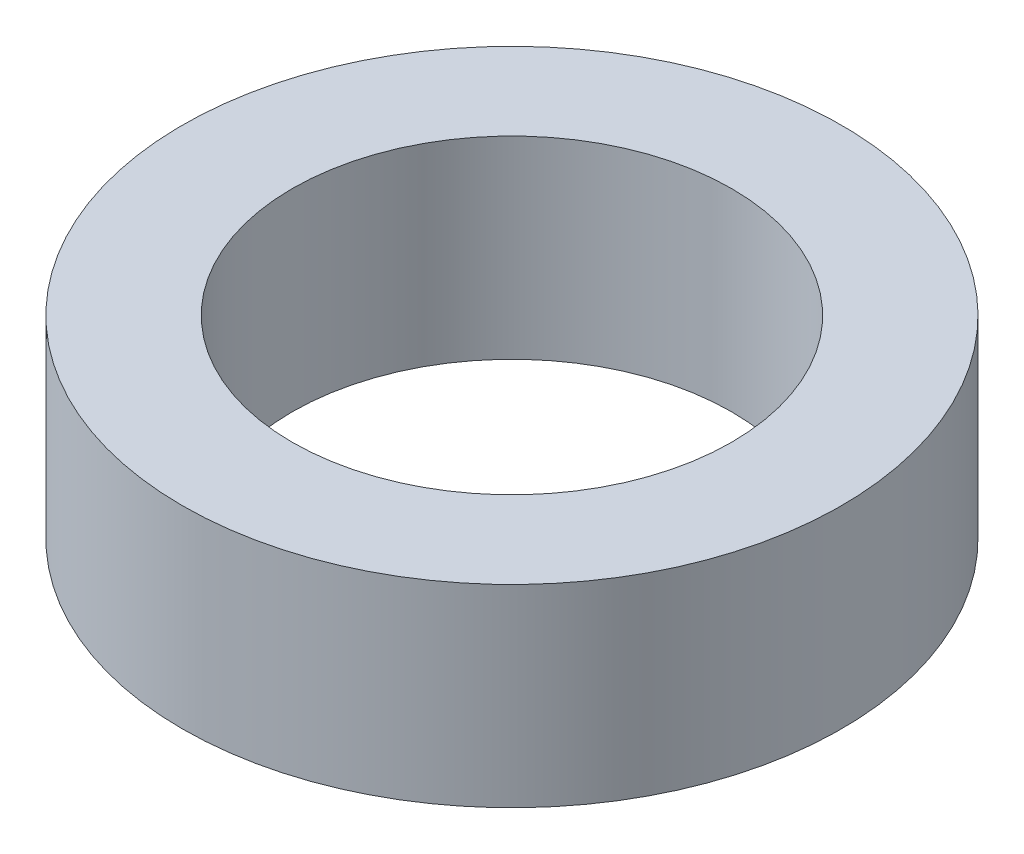
ISO-10303-21;
HEADER;
FILE_DESCRIPTION(('STEP AP214'),'2;1');
FILE_NAME('part.step','',(''),(''),'','','');
FILE_SCHEMA(('AUTOMOTIVE_DESIGN { 1 0 10303 214 1 1 1 1 }'));
ENDSEC;
DATA;
#1=APPLICATION_CONTEXT('core data for automotive mechanical design processes');
#2=APPLICATION_PROTOCOL_DEFINITION('international standard','automotive_design',2000,#1);
#3=PRODUCT_CONTEXT('',#1,'mechanical');
#4=PRODUCT('Part','Part','',(#3));
#5=PRODUCT_RELATED_PRODUCT_CATEGORY('part','',(#4));
#6=PRODUCT_DEFINITION_FORMATION('','',#4);
#7=PRODUCT_DEFINITION_CONTEXT('part definition',#1,'design');
#8=PRODUCT_DEFINITION('design','',#6,#7);
#9=PRODUCT_DEFINITION_SHAPE('','',#8);
#10=(LENGTH_UNIT() NAMED_UNIT(*) SI_UNIT(.MILLI.,.METRE.));
#11=(NAMED_UNIT(*) PLANE_ANGLE_UNIT() SI_UNIT($,.RADIAN.));
#12=(NAMED_UNIT(*) SI_UNIT($,.STERADIAN.) SOLID_ANGLE_UNIT());
#13=UNCERTAINTY_MEASURE_WITH_UNIT(LENGTH_MEASURE(1.E-05),#10,'distance_accuracy_value','');
#14=(GEOMETRIC_REPRESENTATION_CONTEXT(3) GLOBAL_UNCERTAINTY_ASSIGNED_CONTEXT((#13)) GLOBAL_UNIT_ASSIGNED_CONTEXT((#10,
#11,#12)) REPRESENTATION_CONTEXT('',''));
#15=CARTESIAN_POINT('',(0.,0.,0.));
#16=DIRECTION('',(0.,0.,1.));
#17=DIRECTION('',(1.,0.,0.));
#18=AXIS2_PLACEMENT_3D('',#15,#16,#17);
#19=CARTESIAN_POINT('',(0.,5.588,0.));
#20=DIRECTION('',(0.,1.,0.));
#21=DIRECTION('',(0.,0.,1.));
#22=AXIS2_PLACEMENT_3D('',#19,#20,#21);
#23=PLANE('',#22);
#24=CARTESIAN_POINT('',(0.,5.588,0.));
#25=DIRECTION('',(0.,1.,0.));
#26=DIRECTION('',(0.,0.,1.));
#27=AXIS2_PLACEMENT_3D('',#24,#25,#26);
#28=CIRCLE('',#27,9.52500000000001);
#29=CARTESIAN_POINT('',(0.,5.588,9.52500000000001));
#30=VERTEX_POINT('',#29);
#31=EDGE_CURVE('E10',#30,#30,#28,.T.);
#32=ORIENTED_EDGE('',*,*,#31,.T.);
#33=EDGE_LOOP('',(#32));
#34=FACE_BOUND('',#33,.T.);
#35=CARTESIAN_POINT('',(0.,5.588,0.));
#36=DIRECTION('',(0.,1.,0.));
#37=DIRECTION('',(0.,0.,1.));
#38=AXIS2_PLACEMENT_3D('',#35,#36,#37);
#39=CIRCLE('',#38,6.35);
#40=CARTESIAN_POINT('',(0.,5.588,6.35));
#41=VERTEX_POINT('',#40);
#42=EDGE_CURVE('E41',#41,#41,#39,.T.);
#43=ORIENTED_EDGE('',*,*,#42,.F.);
#44=EDGE_LOOP('',(#43));
#45=FACE_BOUND('',#44,.T.);
#46=ADVANCED_FACE('F30',(#34,#45),#23,.T.);
#47=CARTESIAN_POINT('',(0.,0.,0.));
#48=DIRECTION('',(0.,1.,0.));
#49=DIRECTION('',(0.,0.,1.));
#50=AXIS2_PLACEMENT_3D('',#47,#48,#49);
#51=PLANE('',#50);
#52=CARTESIAN_POINT('',(0.,0.,0.));
#53=DIRECTION('',(0.,1.,0.));
#54=DIRECTION('',(0.,0.,1.));
#55=AXIS2_PLACEMENT_3D('',#52,#53,#54);
#56=CIRCLE('',#55,9.52500000000001);
#57=CARTESIAN_POINT('',(0.,0.,9.52500000000001));
#58=VERTEX_POINT('',#57);
#59=EDGE_CURVE('E34',#58,#58,#56,.T.);
#60=ORIENTED_EDGE('',*,*,#59,.F.);
#61=EDGE_LOOP('',(#60));
#62=FACE_BOUND('',#61,.T.);
#63=CARTESIAN_POINT('',(0.,0.,0.));
#64=DIRECTION('',(0.,1.,0.));
#65=DIRECTION('',(0.,0.,1.));
#66=AXIS2_PLACEMENT_3D('',#63,#64,#65);
#67=CIRCLE('',#66,6.35);
#68=CARTESIAN_POINT('',(0.,0.,6.35));
#69=VERTEX_POINT('',#68);
#70=EDGE_CURVE('E43',#69,#69,#67,.T.);
#71=ORIENTED_EDGE('',*,*,#70,.T.);
#72=EDGE_LOOP('',(#71));
#73=FACE_BOUND('',#72,.T.);
#74=ADVANCED_FACE('F53',(#62,#73),#51,.F.);
#75=CARTESIAN_POINT('',(0.,5.588,0.));
#76=DIRECTION('',(0.,-1.,0.));
#77=DIRECTION('',(0.,0.,-1.));
#78=AXIS2_PLACEMENT_3D('',#75,#76,#77);
#79=CYLINDRICAL_SURFACE('',#78,9.52500000000001);
#80=ORIENTED_EDGE('',*,*,#31,.F.);
#81=EDGE_LOOP('',(#80));
#82=FACE_BOUND('',#81,.T.);
#83=ORIENTED_EDGE('',*,*,#59,.T.);
#84=EDGE_LOOP('',(#83));
#85=FACE_BOUND('',#84,.T.);
#86=ADVANCED_FACE('F32',(#82,#85),#79,.T.);
#87=CARTESIAN_POINT('',(0.,5.588,0.));
#88=DIRECTION('',(0.,-1.,0.));
#89=DIRECTION('',(0.,0.,-1.));
#90=AXIS2_PLACEMENT_3D('',#87,#88,#89);
#91=CYLINDRICAL_SURFACE('',#90,6.35);
#92=ORIENTED_EDGE('',*,*,#42,.T.);
#93=EDGE_LOOP('',(#92));
#94=FACE_BOUND('',#93,.T.);
#95=ORIENTED_EDGE('',*,*,#70,.F.);
#96=EDGE_LOOP('',(#95));
#97=FACE_BOUND('',#96,.T.);
#98=ADVANCED_FACE('F49',(#94,#97),#91,.F.);
#99=CLOSED_SHELL('',(#46,#74,#86,#98));
#100=MANIFOLD_SOLID_BREP('B2',#99);
#101=ADVANCED_BREP_SHAPE_REPRESENTATION('',(#18,#100),#14);
#102=SHAPE_DEFINITION_REPRESENTATION(#9,#101);
ENDSEC;
END-ISO-10303-21;
